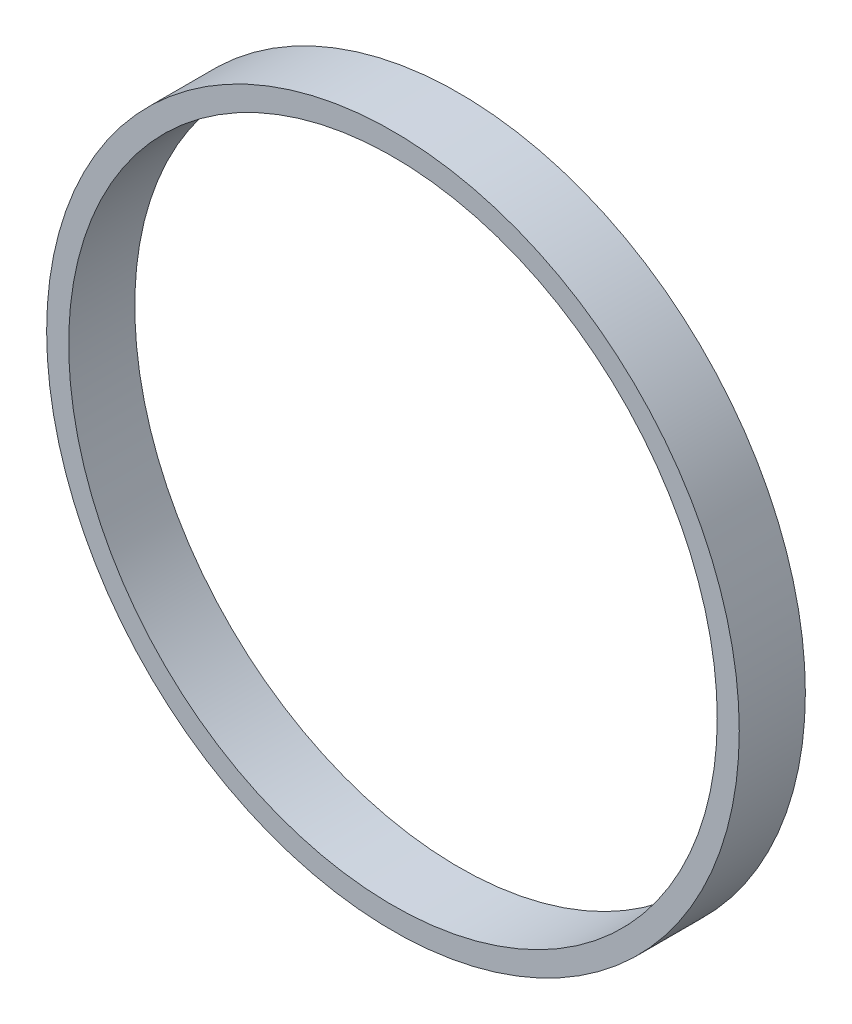
ISO-10303-21;
HEADER;
FILE_DESCRIPTION(('STEP AP214'),'2;1');
FILE_NAME('part.step','',(''),(''),'','','');
FILE_SCHEMA(('AUTOMOTIVE_DESIGN { 1 0 10303 214 1 1 1 1 }'));
ENDSEC;
DATA;
#1=APPLICATION_CONTEXT('core data for automotive mechanical design processes');
#2=APPLICATION_PROTOCOL_DEFINITION('international standard','automotive_design',2000,#1);
#3=PRODUCT_CONTEXT('',#1,'mechanical');
#4=PRODUCT('Part','Part','',(#3));
#5=PRODUCT_RELATED_PRODUCT_CATEGORY('part','',(#4));
#6=PRODUCT_DEFINITION_FORMATION('','',#4);
#7=PRODUCT_DEFINITION_CONTEXT('part definition',#1,'design');
#8=PRODUCT_DEFINITION('design','',#6,#7);
#9=PRODUCT_DEFINITION_SHAPE('','',#8);
#10=(LENGTH_UNIT() NAMED_UNIT(*) SI_UNIT(.MILLI.,.METRE.));
#11=(NAMED_UNIT(*) PLANE_ANGLE_UNIT() SI_UNIT($,.RADIAN.));
#12=(NAMED_UNIT(*) SI_UNIT($,.STERADIAN.) SOLID_ANGLE_UNIT());
#13=UNCERTAINTY_MEASURE_WITH_UNIT(LENGTH_MEASURE(1.E-05),#10,'distance_accuracy_value','');
#14=(GEOMETRIC_REPRESENTATION_CONTEXT(3) GLOBAL_UNCERTAINTY_ASSIGNED_CONTEXT((#13)) GLOBAL_UNIT_ASSIGNED_CONTEXT((#10,
#11,#12)) REPRESENTATION_CONTEXT('',''));
#15=CARTESIAN_POINT('',(0.,0.,0.));
#16=DIRECTION('',(0.,0.,1.));
#17=DIRECTION('',(1.,0.,0.));
#18=AXIS2_PLACEMENT_3D('',#15,#16,#17);
#19=CARTESIAN_POINT('',(0.,0.,4.7625));
#20=DIRECTION('',(0.,0.,1.));
#21=DIRECTION('',(1.,0.,0.));
#22=AXIS2_PLACEMENT_3D('',#19,#20,#21);
#23=PLANE('',#22);
#24=CARTESIAN_POINT('',(0.,0.,4.7625));
#25=DIRECTION('',(0.,0.,1.));
#26=DIRECTION('',(1.,0.,0.));
#27=AXIS2_PLACEMENT_3D('',#24,#25,#26);
#28=CIRCLE('',#27,24.9555);
#29=CARTESIAN_POINT('',(24.9555,0.,4.7625));
#30=VERTEX_POINT('',#29);
#31=EDGE_CURVE('E12',#30,#30,#28,.T.);
#32=ORIENTED_EDGE('',*,*,#31,.T.);
#33=EDGE_LOOP('',(#32));
#34=FACE_BOUND('',#33,.T.);
#35=CARTESIAN_POINT('',(0.,0.,4.7625));
#36=DIRECTION('',(0.,0.,1.));
#37=DIRECTION('',(1.,0.,0.));
#38=AXIS2_PLACEMENT_3D('',#35,#36,#37);
#39=CIRCLE('',#38,23.368);
#40=CARTESIAN_POINT('',(23.368,0.,4.7625));
#41=VERTEX_POINT('',#40);
#42=EDGE_CURVE('E55',#41,#41,#39,.T.);
#43=ORIENTED_EDGE('',*,*,#42,.F.);
#44=EDGE_LOOP('',(#43));
#45=FACE_BOUND('',#44,.T.);
#46=ADVANCED_FACE('F44',(#34,#45),#23,.T.);
#47=CARTESIAN_POINT('',(0.,0.,0.));
#48=DIRECTION('',(0.,0.,1.));
#49=DIRECTION('',(1.,0.,0.));
#50=AXIS2_PLACEMENT_3D('',#47,#48,#49);
#51=PLANE('',#50);
#52=CARTESIAN_POINT('',(0.,0.,0.));
#53=DIRECTION('',(0.,0.,1.));
#54=DIRECTION('',(1.,0.,0.));
#55=AXIS2_PLACEMENT_3D('',#52,#53,#54);
#56=CIRCLE('',#55,24.9555);
#57=CARTESIAN_POINT('',(24.9555,0.,0.));
#58=VERTEX_POINT('',#57);
#59=EDGE_CURVE('E48',#58,#58,#56,.T.);
#60=ORIENTED_EDGE('',*,*,#59,.F.);
#61=EDGE_LOOP('',(#60));
#62=FACE_BOUND('',#61,.T.);
#63=CARTESIAN_POINT('',(0.,0.,0.));
#64=DIRECTION('',(0.,0.,1.));
#65=DIRECTION('',(1.,0.,0.));
#66=AXIS2_PLACEMENT_3D('',#63,#64,#65);
#67=CIRCLE('',#66,23.368);
#68=CARTESIAN_POINT('',(23.368,0.,0.));
#69=VERTEX_POINT('',#68);
#70=EDGE_CURVE('E57',#69,#69,#67,.T.);
#71=ORIENTED_EDGE('',*,*,#70,.T.);
#72=EDGE_LOOP('',(#71));
#73=FACE_BOUND('',#72,.T.);
#74=ADVANCED_FACE('F67',(#62,#73),#51,.F.);
#75=CARTESIAN_POINT('',(0.,0.,4.7625));
#76=DIRECTION('',(0.,0.,-1.));
#77=DIRECTION('',(-1.,0.,0.));
#78=AXIS2_PLACEMENT_3D('',#75,#76,#77);
#79=CYLINDRICAL_SURFACE('',#78,24.9555);
#80=ORIENTED_EDGE('',*,*,#31,.F.);
#81=EDGE_LOOP('',(#80));
#82=FACE_BOUND('',#81,.T.);
#83=ORIENTED_EDGE('',*,*,#59,.T.);
#84=EDGE_LOOP('',(#83));
#85=FACE_BOUND('',#84,.T.);
#86=ADVANCED_FACE('F46',(#82,#85),#79,.T.);
#87=CARTESIAN_POINT('',(0.,0.,4.7625));
#88=DIRECTION('',(0.,0.,-1.));
#89=DIRECTION('',(-1.,0.,0.));
#90=AXIS2_PLACEMENT_3D('',#87,#88,#89);
#91=CYLINDRICAL_SURFACE('',#90,23.368);
#92=ORIENTED_EDGE('',*,*,#42,.T.);
#93=EDGE_LOOP('',(#92));
#94=FACE_BOUND('',#93,.T.);
#95=ORIENTED_EDGE('',*,*,#70,.F.);
#96=EDGE_LOOP('',(#95));
#97=FACE_BOUND('',#96,.T.);
#98=ADVANCED_FACE('F63',(#94,#97),#91,.F.);
#99=CLOSED_SHELL('',(#46,#74,#86,#98));
#100=MANIFOLD_SOLID_BREP('B2',#99);
#101=ADVANCED_BREP_SHAPE_REPRESENTATION('',(#18,#100),#14);
#102=SHAPE_DEFINITION_REPRESENTATION(#9,#101);
ENDSEC;
END-ISO-10303-21;
